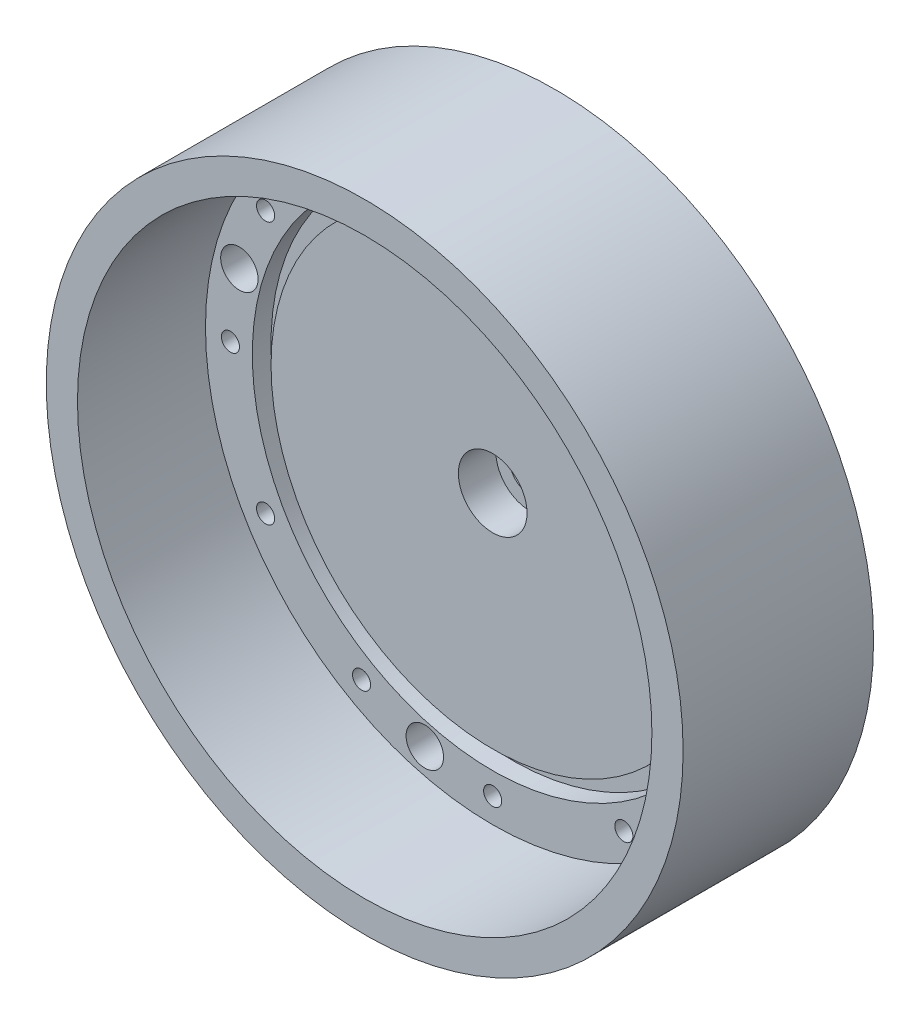
ISO-10303-21;
HEADER;
FILE_DESCRIPTION(('STEP AP214'),'2;1');
FILE_NAME('part.step','',(''),(''),'','','');
FILE_SCHEMA(('AUTOMOTIVE_DESIGN { 1 0 10303 214 1 1 1 1 }'));
ENDSEC;
DATA;
#1=APPLICATION_CONTEXT('core data for automotive mechanical design processes');
#2=APPLICATION_PROTOCOL_DEFINITION('international standard','automotive_design',2000,#1);
#3=PRODUCT_CONTEXT('',#1,'mechanical');
#4=PRODUCT('Part','Part','',(#3));
#5=PRODUCT_RELATED_PRODUCT_CATEGORY('part','',(#4));
#6=PRODUCT_DEFINITION_FORMATION('','',#4);
#7=PRODUCT_DEFINITION_CONTEXT('part definition',#1,'design');
#8=PRODUCT_DEFINITION('design','',#6,#7);
#9=PRODUCT_DEFINITION_SHAPE('','',#8);
#10=(LENGTH_UNIT() NAMED_UNIT(*) SI_UNIT(.MILLI.,.METRE.));
#11=(NAMED_UNIT(*) PLANE_ANGLE_UNIT() SI_UNIT($,.RADIAN.));
#12=(NAMED_UNIT(*) SI_UNIT($,.STERADIAN.) SOLID_ANGLE_UNIT());
#13=UNCERTAINTY_MEASURE_WITH_UNIT(LENGTH_MEASURE(1.E-05),#10,'distance_accuracy_value','');
#14=(GEOMETRIC_REPRESENTATION_CONTEXT(3) GLOBAL_UNCERTAINTY_ASSIGNED_CONTEXT((#13)) GLOBAL_UNIT_ASSIGNED_CONTEXT((#10,
#11,#12)) REPRESENTATION_CONTEXT('',''));
#15=CARTESIAN_POINT('',(0.,0.,0.));
#16=DIRECTION('',(0.,0.,1.));
#17=DIRECTION('',(1.,0.,0.));
#18=AXIS2_PLACEMENT_3D('',#15,#16,#17);
#19=CARTESIAN_POINT('',(0.,-5.05767303038418E-11,0.));
#20=DIRECTION('',(0.,0.,1.));
#21=DIRECTION('',(1.,0.,0.));
#22=AXIS2_PLACEMENT_3D('',#19,#20,#21);
#23=PLANE('',#22);
#24=CARTESIAN_POINT('',(0.,0.,0.));
#25=DIRECTION('',(0.,0.,1.));
#26=DIRECTION('',(1.,0.,0.));
#27=AXIS2_PLACEMENT_3D('',#24,#25,#26);
#28=CIRCLE('',#27,3.3);
#29=CARTESIAN_POINT('',(3.3,0.,0.));
#30=VERTEX_POINT('',#29);
#31=EDGE_CURVE('E464',#30,#30,#28,.T.);
#32=ORIENTED_EDGE('',*,*,#31,.T.);
#33=EDGE_LOOP('',(#32));
#34=FACE_BOUND('',#33,.T.);
#35=CARTESIAN_POINT('',(10.8703998943058,40.5688847041003,0.));
#36=DIRECTION('',(0.,0.,-1.));
#37=DIRECTION('',(-1.,0.,0.));
#38=AXIS2_PLACEMENT_3D('',#35,#36,#37);
#39=CIRCLE('',#38,3.);
#40=CARTESIAN_POINT('',(7.87039989430581,40.5688847041003,0.));
#41=VERTEX_POINT('',#40);
#42=EDGE_CURVE('E476',#41,#41,#39,.T.);
#43=ORIENTED_EDGE('',*,*,#42,.F.);
#44=EDGE_LOOP('',(#43));
#45=FACE_BOUND('',#44,.T.);
#46=CARTESIAN_POINT('',(-40.568884704141,10.8703998942653,0.));
#47=DIRECTION('',(0.,0.,-1.));
#48=DIRECTION('',(-1.,0.,0.));
#49=AXIS2_PLACEMENT_3D('',#46,#47,#48);
#50=CIRCLE('',#49,3.);
#51=CARTESIAN_POINT('',(-43.568884704141,10.8703998942653,0.));
#52=VERTEX_POINT('',#51);
#53=EDGE_CURVE('E89',#52,#52,#50,.T.);
#54=ORIENTED_EDGE('',*,*,#53,.F.);
#55=EDGE_LOOP('',(#54));
#56=FACE_BOUND('',#55,.T.);
#57=CARTESIAN_POINT('',(-10.870399894306,-40.5688847041815,0.));
#58=DIRECTION('',(0.,0.,-1.));
#59=DIRECTION('',(-1.,0.,0.));
#60=AXIS2_PLACEMENT_3D('',#57,#58,#59);
#61=CIRCLE('',#60,3.);
#62=CARTESIAN_POINT('',(-13.870399894306,-40.5688847041815,0.));
#63=VERTEX_POINT('',#62);
#64=EDGE_CURVE('E77',#63,#63,#61,.T.);
#65=ORIENTED_EDGE('',*,*,#64,.F.);
#66=EDGE_LOOP('',(#65));
#67=FACE_BOUND('',#66,.T.);
#68=CARTESIAN_POINT('',(40.5688847041408,-10.8703998943465,0.));
#69=DIRECTION('',(0.,0.,-1.));
#70=DIRECTION('',(-1.,0.,0.));
#71=AXIS2_PLACEMENT_3D('',#68,#69,#70);
#72=CIRCLE('',#71,3.);
#73=CARTESIAN_POINT('',(37.5688847041408,-10.8703998943465,0.));
#74=VERTEX_POINT('',#73);
#75=EDGE_CURVE('E76',#74,#74,#72,.T.);
#76=ORIENTED_EDGE('',*,*,#75,.F.);
#77=EDGE_LOOP('',(#76));
#78=FACE_BOUND('',#77,.T.);
#79=CARTESIAN_POINT('',(-21.0000000000001,36.3730669589058,0.));
#80=DIRECTION('',(0.,0.,-1.));
#81=DIRECTION('',(-1.,0.,0.));
#82=AXIS2_PLACEMENT_3D('',#79,#80,#81);
#83=CIRCLE('',#82,1.45);
#84=CARTESIAN_POINT('',(-22.4500000000001,36.3730669589058,0.));
#85=VERTEX_POINT('',#84);
#86=EDGE_CURVE('E73',#85,#85,#83,.T.);
#87=ORIENTED_EDGE('',*,*,#86,.F.);
#88=EDGE_LOOP('',(#87));
#89=FACE_BOUND('',#88,.T.);
#90=CARTESIAN_POINT('',(-36.3730669589465,20.9999999999594,0.));
#91=DIRECTION('',(0.,0.,-1.));
#92=DIRECTION('',(-1.,0.,0.));
#93=AXIS2_PLACEMENT_3D('',#90,#91,#92);
#94=CIRCLE('',#93,1.45);
#95=CARTESIAN_POINT('',(-37.8230669589465,20.9999999999594,0.));
#96=VERTEX_POINT('',#95);
#97=EDGE_CURVE('E72',#96,#96,#94,.T.);
#98=ORIENTED_EDGE('',*,*,#97,.F.);
#99=EDGE_LOOP('',(#98));
#100=FACE_BOUND('',#99,.T.);
#101=CARTESIAN_POINT('',(-36.3730669589465,-21.0000000000406,0.));
#102=DIRECTION('',(0.,0.,-1.));
#103=DIRECTION('',(-1.,0.,0.));
#104=AXIS2_PLACEMENT_3D('',#101,#102,#103);
#105=CIRCLE('',#104,1.45);
#106=CARTESIAN_POINT('',(-37.8230669589465,-21.0000000000406,0.));
#107=VERTEX_POINT('',#106);
#108=EDGE_CURVE('E68',#107,#107,#105,.T.);
#109=ORIENTED_EDGE('',*,*,#108,.F.);
#110=EDGE_LOOP('',(#109));
#111=FACE_BOUND('',#110,.T.);
#112=CARTESIAN_POINT('',(-21.0000000000001,-36.373066958987,0.));
#113=DIRECTION('',(0.,0.,-1.));
#114=DIRECTION('',(-1.,0.,0.));
#115=AXIS2_PLACEMENT_3D('',#112,#113,#114);
#116=CIRCLE('',#115,1.45);
#117=CARTESIAN_POINT('',(-22.4500000000001,-36.373066958987,0.));
#118=VERTEX_POINT('',#117);
#119=EDGE_CURVE('E64',#118,#118,#116,.T.);
#120=ORIENTED_EDGE('',*,*,#119,.F.);
#121=EDGE_LOOP('',(#120));
#122=FACE_BOUND('',#121,.T.);
#123=CARTESIAN_POINT('',(0.,-42.0000000000406,0.));
#124=DIRECTION('',(0.,0.,-1.));
#125=DIRECTION('',(-1.,0.,0.));
#126=AXIS2_PLACEMENT_3D('',#123,#124,#125);
#127=CIRCLE('',#126,1.45);
#128=CARTESIAN_POINT('',(-1.45000000000008,-42.0000000000406,0.));
#129=VERTEX_POINT('',#128);
#130=EDGE_CURVE('E63',#129,#129,#127,.T.);
#131=ORIENTED_EDGE('',*,*,#130,.F.);
#132=EDGE_LOOP('',(#131));
#133=FACE_BOUND('',#132,.T.);
#134=CARTESIAN_POINT('',(20.9999999999999,-36.373066958987,0.));
#135=DIRECTION('',(0.,0.,-1.));
#136=DIRECTION('',(-1.,0.,0.));
#137=AXIS2_PLACEMENT_3D('',#134,#135,#136);
#138=CIRCLE('',#137,1.45);
#139=CARTESIAN_POINT('',(19.5499999999999,-36.373066958987,0.));
#140=VERTEX_POINT('',#139);
#141=EDGE_CURVE('E116',#140,#140,#138,.T.);
#142=ORIENTED_EDGE('',*,*,#141,.F.);
#143=EDGE_LOOP('',(#142));
#144=FACE_BOUND('',#143,.T.);
#145=CARTESIAN_POINT('',(36.3730669589463,-21.0000000000406,0.));
#146=DIRECTION('',(0.,0.,-1.));
#147=DIRECTION('',(-1.,0.,0.));
#148=AXIS2_PLACEMENT_3D('',#145,#146,#147);
#149=CIRCLE('',#148,1.45);
#150=CARTESIAN_POINT('',(34.9230669589463,-21.0000000000406,0.));
#151=VERTEX_POINT('',#150);
#152=EDGE_CURVE('E122',#151,#151,#149,.T.);
#153=ORIENTED_EDGE('',*,*,#152,.F.);
#154=EDGE_LOOP('',(#153));
#155=FACE_BOUND('',#154,.T.);
#156=CARTESIAN_POINT('',(41.9999999999999,-4.05743147413595E-11,0.));
#157=DIRECTION('',(0.,0.,-1.));
#158=DIRECTION('',(-1.,0.,0.));
#159=AXIS2_PLACEMENT_3D('',#156,#157,#158);
#160=CIRCLE('',#159,1.45);
#161=CARTESIAN_POINT('',(40.5499999999999,-4.05743147413595E-11,0.));
#162=VERTEX_POINT('',#161);
#163=EDGE_CURVE('E128',#162,#162,#160,.T.);
#164=ORIENTED_EDGE('',*,*,#163,.F.);
#165=EDGE_LOOP('',(#164));
#166=FACE_BOUND('',#165,.T.);
#167=CARTESIAN_POINT('',(36.3730669589463,20.9999999999594,0.));
#168=DIRECTION('',(0.,0.,-1.));
#169=DIRECTION('',(-1.,0.,0.));
#170=AXIS2_PLACEMENT_3D('',#167,#168,#169);
#171=CIRCLE('',#170,1.45);
#172=CARTESIAN_POINT('',(34.9230669589463,20.9999999999594,0.));
#173=VERTEX_POINT('',#172);
#174=EDGE_CURVE('E134',#173,#173,#171,.T.);
#175=ORIENTED_EDGE('',*,*,#174,.F.);
#176=EDGE_LOOP('',(#175));
#177=FACE_BOUND('',#176,.T.);
#178=CARTESIAN_POINT('',(20.9999999999999,36.3730669589058,0.));
#179=DIRECTION('',(0.,0.,-1.));
#180=DIRECTION('',(-1.,0.,0.));
#181=AXIS2_PLACEMENT_3D('',#178,#179,#180);
#182=CIRCLE('',#181,1.45);
#183=CARTESIAN_POINT('',(19.5499999999999,36.3730669589058,0.));
#184=VERTEX_POINT('',#183);
#185=EDGE_CURVE('E140',#184,#184,#182,.T.);
#186=ORIENTED_EDGE('',*,*,#185,.F.);
#187=EDGE_LOOP('',(#186));
#188=FACE_BOUND('',#187,.T.);
#189=CARTESIAN_POINT('',(0.,41.9999999999594,0.));
#190=DIRECTION('',(0.,0.,-1.));
#191=DIRECTION('',(-1.,0.,0.));
#192=AXIS2_PLACEMENT_3D('',#189,#190,#191);
#193=CIRCLE('',#192,1.45);
#194=CARTESIAN_POINT('',(-1.45000000000009,41.9999999999594,0.));
#195=VERTEX_POINT('',#194);
#196=EDGE_CURVE('E59',#195,#195,#193,.T.);
#197=ORIENTED_EDGE('',*,*,#196,.F.);
#198=EDGE_LOOP('',(#197));
#199=FACE_BOUND('',#198,.T.);
#200=CARTESIAN_POINT('',(0.,-5.05767303038418E-11,0.));
#201=DIRECTION('',(0.,0.,1.));
#202=DIRECTION('',(1.,0.,0.));
#203=AXIS2_PLACEMENT_3D('',#200,#201,#202);
#204=CIRCLE('',#203,51.0000000000607);
#205=CARTESIAN_POINT('',(51.0000000000606,-5.05767303038418E-11,0.));
#206=VERTEX_POINT('',#205);
#207=EDGE_CURVE('E45',#206,#206,#204,.T.);
#208=ORIENTED_EDGE('',*,*,#207,.F.);
#209=EDGE_LOOP('',(#208));
#210=FACE_BOUND('',#209,.T.);
#211=CARTESIAN_POINT('',(-42.0000000000001,-4.05786515500495E-11,0.));
#212=DIRECTION('',(0.,0.,-1.));
#213=DIRECTION('',(-1.,0.,0.));
#214=AXIS2_PLACEMENT_3D('',#211,#212,#213);
#215=CIRCLE('',#214,1.45);
#216=CARTESIAN_POINT('',(-43.4500000000001,-4.05786515500495E-11,0.));
#217=VERTEX_POINT('',#216);
#218=EDGE_CURVE('E69',#217,#217,#215,.T.);
#219=ORIENTED_EDGE('',*,*,#218,.F.);
#220=EDGE_LOOP('',(#219));
#221=FACE_BOUND('',#220,.T.);
#222=ADVANCED_FACE('F37',(#34,#45,#56,#67,#78,#89,#100,#111,#122,#133,#144,#155,#166,#177,#188,
#199,#210,#221),#23,.F.);
#223=CARTESIAN_POINT('',(0.,-5.05767303038418E-11,30.5));
#224=DIRECTION('',(0.,0.,-1.));
#225=DIRECTION('',(-1.,0.,0.));
#226=AXIS2_PLACEMENT_3D('',#223,#224,#225);
#227=CYLINDRICAL_SURFACE('',#226,51.0000000000607);
#228=CARTESIAN_POINT('',(0.,-5.05767303038418E-11,30.5));
#229=DIRECTION('',(0.,0.,1.));
#230=DIRECTION('',(1.,0.,0.));
#231=AXIS2_PLACEMENT_3D('',#228,#229,#230);
#232=CIRCLE('',#231,51.0000000000607);
#233=CARTESIAN_POINT('',(51.0000000000606,-5.05767303038418E-11,30.5));
#234=VERTEX_POINT('',#233);
#235=EDGE_CURVE('E11',#234,#234,#232,.T.);
#236=ORIENTED_EDGE('',*,*,#235,.F.);
#237=EDGE_LOOP('',(#236));
#238=FACE_BOUND('',#237,.T.);
#239=ORIENTED_EDGE('',*,*,#207,.T.);
#240=EDGE_LOOP('',(#239));
#241=FACE_BOUND('',#240,.T.);
#242=ADVANCED_FACE('F39',(#238,#241),#227,.T.);
#243=CARTESIAN_POINT('',(0.,-5.05767303038418E-11,30.5));
#244=DIRECTION('',(0.,0.,1.));
#245=DIRECTION('',(1.,0.,0.));
#246=AXIS2_PLACEMENT_3D('',#243,#244,#245);
#247=PLANE('',#246);
#248=CARTESIAN_POINT('',(0.,-5.05767303038418E-11,30.5));
#249=DIRECTION('',(0.,0.,1.));
#250=DIRECTION('',(1.,0.,0.));
#251=AXIS2_PLACEMENT_3D('',#248,#249,#250);
#252=CIRCLE('',#251,46.00000000001);
#253=CARTESIAN_POINT('',(46.0000000000099,-5.05767303038418E-11,30.5));
#254=VERTEX_POINT('',#253);
#255=EDGE_CURVE('E58',#254,#254,#252,.T.);
#256=ORIENTED_EDGE('',*,*,#255,.F.);
#257=EDGE_LOOP('',(#256));
#258=FACE_BOUND('',#257,.T.);
#259=ORIENTED_EDGE('',*,*,#235,.T.);
#260=EDGE_LOOP('',(#259));
#261=FACE_BOUND('',#260,.T.);
#262=ADVANCED_FACE('F168',(#258,#261),#247,.T.);
#263=CARTESIAN_POINT('',(0.,-5.05767303038418E-11,-130.107647738353));
#264=DIRECTION('',(0.,0.,1.));
#265=DIRECTION('',(1.,0.,0.));
#266=AXIS2_PLACEMENT_3D('',#263,#264,#265);
#267=CYLINDRICAL_SURFACE('',#266,46.00000000001);
#268=CARTESIAN_POINT('',(0.,-5.05767303038418E-11,10.));
#269=DIRECTION('',(0.,0.,1.));
#270=DIRECTION('',(1.,0.,0.));
#271=AXIS2_PLACEMENT_3D('',#268,#269,#270);
#272=CIRCLE('',#271,46.00000000001);
#273=CARTESIAN_POINT('',(46.0000000000099,-5.05767303038418E-11,10.));
#274=VERTEX_POINT('',#273);
#275=EDGE_CURVE('E50',#274,#274,#272,.F.);
#276=ORIENTED_EDGE('',*,*,#275,.T.);
#277=EDGE_LOOP('',(#276));
#278=FACE_BOUND('',#277,.T.);
#279=ORIENTED_EDGE('',*,*,#255,.T.);
#280=EDGE_LOOP('',(#279));
#281=FACE_BOUND('',#280,.T.);
#282=ADVANCED_FACE('F153',(#278,#281),#267,.F.);
#283=CARTESIAN_POINT('',(0.,-5.05767303038418E-11,10.));
#284=DIRECTION('',(0.,0.,1.));
#285=DIRECTION('',(1.,0.,0.));
#286=AXIS2_PLACEMENT_3D('',#283,#284,#285);
#287=PLANE('',#286);
#288=CARTESIAN_POINT('',(0.,-5.05767303038418E-11,10.));
#289=DIRECTION('',(0.,0.,1.));
#290=DIRECTION('',(1.,0.,0.));
#291=AXIS2_PLACEMENT_3D('',#288,#289,#290);
#292=CIRCLE('',#291,38.5);
#293=CARTESIAN_POINT('',(38.4999999999999,-5.05767303038418E-11,10.));
#294=VERTEX_POINT('',#293);
#295=EDGE_CURVE('E470',#294,#294,#292,.T.);
#296=ORIENTED_EDGE('',*,*,#295,.F.);
#297=EDGE_LOOP('',(#296));
#298=FACE_BOUND('',#297,.T.);
#299=CARTESIAN_POINT('',(10.8703998943058,40.5688847041003,10.));
#300=DIRECTION('',(0.,0.,1.));
#301=DIRECTION('',(1.,0.,0.));
#302=AXIS2_PLACEMENT_3D('',#299,#300,#301);
#303=CIRCLE('',#302,2.99999999999999);
#304=CARTESIAN_POINT('',(13.8703998943058,40.5688847041003,10.));
#305=VERTEX_POINT('',#304);
#306=EDGE_CURVE('E41',#305,#305,#303,.T.);
#307=ORIENTED_EDGE('',*,*,#306,.F.);
#308=EDGE_LOOP('',(#307));
#309=FACE_BOUND('',#308,.T.);
#310=CARTESIAN_POINT('',(-40.568884704141,10.8703998942653,10.));
#311=DIRECTION('',(0.,0.,1.));
#312=DIRECTION('',(1.,0.,0.));
#313=AXIS2_PLACEMENT_3D('',#310,#311,#312);
#314=CIRCLE('',#313,3.);
#315=CARTESIAN_POINT('',(-37.568884704141,10.8703998942653,10.));
#316=VERTEX_POINT('',#315);
#317=EDGE_CURVE('E84',#316,#316,#314,.T.);
#318=ORIENTED_EDGE('',*,*,#317,.F.);
#319=EDGE_LOOP('',(#318));
#320=FACE_BOUND('',#319,.T.);
#321=CARTESIAN_POINT('',(-10.870399894306,-40.5688847041815,10.));
#322=DIRECTION('',(0.,0.,1.));
#323=DIRECTION('',(1.,0.,0.));
#324=AXIS2_PLACEMENT_3D('',#321,#322,#323);
#325=CIRCLE('',#324,2.99999999999999);
#326=CARTESIAN_POINT('',(-7.870399894306,-40.5688847041815,10.));
#327=VERTEX_POINT('',#326);
#328=EDGE_CURVE('E74',#327,#327,#325,.T.);
#329=ORIENTED_EDGE('',*,*,#328,.F.);
#330=EDGE_LOOP('',(#329));
#331=FACE_BOUND('',#330,.T.);
#332=CARTESIAN_POINT('',(40.5688847041408,-10.8703998943465,10.));
#333=DIRECTION('',(0.,0.,1.));
#334=DIRECTION('',(1.,0.,0.));
#335=AXIS2_PLACEMENT_3D('',#332,#333,#334);
#336=CIRCLE('',#335,3.);
#337=CARTESIAN_POINT('',(43.5688847041408,-10.8703998943465,10.));
#338=VERTEX_POINT('',#337);
#339=EDGE_CURVE('E81',#338,#338,#336,.T.);
#340=ORIENTED_EDGE('',*,*,#339,.F.);
#341=EDGE_LOOP('',(#340));
#342=FACE_BOUND('',#341,.T.);
#343=CARTESIAN_POINT('',(-21.0000000000001,36.3730669589058,10.));
#344=DIRECTION('',(0.,0.,1.));
#345=DIRECTION('',(1.,0.,0.));
#346=AXIS2_PLACEMENT_3D('',#343,#344,#345);
#347=CIRCLE('',#346,1.44999999999999);
#348=CARTESIAN_POINT('',(-19.5500000000001,36.3730669589058,10.));
#349=VERTEX_POINT('',#348);
#350=EDGE_CURVE('E70',#349,#349,#347,.T.);
#351=ORIENTED_EDGE('',*,*,#350,.F.);
#352=EDGE_LOOP('',(#351));
#353=FACE_BOUND('',#352,.T.);
#354=CARTESIAN_POINT('',(-36.3730669589465,20.9999999999594,10.));
#355=DIRECTION('',(0.,0.,1.));
#356=DIRECTION('',(1.,0.,0.));
#357=AXIS2_PLACEMENT_3D('',#354,#355,#356);
#358=CIRCLE('',#357,1.45);
#359=CARTESIAN_POINT('',(-34.9230669589465,20.9999999999594,10.));
#360=VERTEX_POINT('',#359);
#361=EDGE_CURVE('E99',#360,#360,#358,.T.);
#362=ORIENTED_EDGE('',*,*,#361,.F.);
#363=EDGE_LOOP('',(#362));
#364=FACE_BOUND('',#363,.T.);
#365=CARTESIAN_POINT('',(-42.0000000000001,-4.05786515500495E-11,10.));
#366=DIRECTION('',(0.,0.,1.));
#367=DIRECTION('',(1.,0.,0.));
#368=AXIS2_PLACEMENT_3D('',#365,#366,#367);
#369=CIRCLE('',#368,1.45);
#370=CARTESIAN_POINT('',(-40.5500000000001,-4.05786515500495E-11,10.));
#371=VERTEX_POINT('',#370);
#372=EDGE_CURVE('E65',#371,#371,#369,.T.);
#373=ORIENTED_EDGE('',*,*,#372,.F.);
#374=EDGE_LOOP('',(#373));
#375=FACE_BOUND('',#374,.T.);
#376=CARTESIAN_POINT('',(-36.3730669589465,-21.0000000000406,10.));
#377=DIRECTION('',(0.,0.,1.));
#378=DIRECTION('',(1.,0.,0.));
#379=AXIS2_PLACEMENT_3D('',#376,#377,#378);
#380=CIRCLE('',#379,1.45);
#381=CARTESIAN_POINT('',(-34.9230669589465,-21.0000000000406,10.));
#382=VERTEX_POINT('',#381);
#383=EDGE_CURVE('E106',#382,#382,#380,.T.);
#384=ORIENTED_EDGE('',*,*,#383,.F.);
#385=EDGE_LOOP('',(#384));
#386=FACE_BOUND('',#385,.T.);
#387=CARTESIAN_POINT('',(-21.0000000000001,-36.373066958987,10.));
#388=DIRECTION('',(0.,0.,1.));
#389=DIRECTION('',(1.,0.,0.));
#390=AXIS2_PLACEMENT_3D('',#387,#388,#389);
#391=CIRCLE('',#390,1.44999999999999);
#392=CARTESIAN_POINT('',(-19.5500000000001,-36.373066958987,10.));
#393=VERTEX_POINT('',#392);
#394=EDGE_CURVE('E60',#393,#393,#391,.T.);
#395=ORIENTED_EDGE('',*,*,#394,.F.);
#396=EDGE_LOOP('',(#395));
#397=FACE_BOUND('',#396,.T.);
#398=CARTESIAN_POINT('',(0.,-42.0000000000406,10.));
#399=DIRECTION('',(0.,0.,1.));
#400=DIRECTION('',(1.,0.,0.));
#401=AXIS2_PLACEMENT_3D('',#398,#399,#400);
#402=CIRCLE('',#401,1.44999999999999);
#403=CARTESIAN_POINT('',(1.44999999999991,-42.0000000000406,10.));
#404=VERTEX_POINT('',#403);
#405=EDGE_CURVE('E113',#404,#404,#402,.T.);
#406=ORIENTED_EDGE('',*,*,#405,.F.);
#407=EDGE_LOOP('',(#406));
#408=FACE_BOUND('',#407,.T.);
#409=CARTESIAN_POINT('',(20.9999999999999,-36.373066958987,10.));
#410=DIRECTION('',(0.,0.,1.));
#411=DIRECTION('',(1.,0.,0.));
#412=AXIS2_PLACEMENT_3D('',#409,#410,#411);
#413=CIRCLE('',#412,1.44999999999999);
#414=CARTESIAN_POINT('',(22.4499999999999,-36.373066958987,10.));
#415=VERTEX_POINT('',#414);
#416=EDGE_CURVE('E119',#415,#415,#413,.T.);
#417=ORIENTED_EDGE('',*,*,#416,.F.);
#418=EDGE_LOOP('',(#417));
#419=FACE_BOUND('',#418,.T.);
#420=CARTESIAN_POINT('',(36.3730669589463,-21.0000000000406,10.));
#421=DIRECTION('',(0.,0.,1.));
#422=DIRECTION('',(1.,0.,0.));
#423=AXIS2_PLACEMENT_3D('',#420,#421,#422);
#424=CIRCLE('',#423,1.45);
#425=CARTESIAN_POINT('',(37.8230669589463,-21.0000000000406,10.));
#426=VERTEX_POINT('',#425);
#427=EDGE_CURVE('E125',#426,#426,#424,.T.);
#428=ORIENTED_EDGE('',*,*,#427,.F.);
#429=EDGE_LOOP('',(#428));
#430=FACE_BOUND('',#429,.T.);
#431=CARTESIAN_POINT('',(41.9999999999999,-4.05743147413595E-11,10.));
#432=DIRECTION('',(0.,0.,1.));
#433=DIRECTION('',(1.,0.,0.));
#434=AXIS2_PLACEMENT_3D('',#431,#432,#433);
#435=CIRCLE('',#434,1.45);
#436=CARTESIAN_POINT('',(43.4499999999999,-4.05743147413595E-11,10.));
#437=VERTEX_POINT('',#436);
#438=EDGE_CURVE('E131',#437,#437,#435,.T.);
#439=ORIENTED_EDGE('',*,*,#438,.F.);
#440=EDGE_LOOP('',(#439));
#441=FACE_BOUND('',#440,.T.);
#442=CARTESIAN_POINT('',(36.3730669589463,20.9999999999594,10.));
#443=DIRECTION('',(0.,0.,1.));
#444=DIRECTION('',(1.,0.,0.));
#445=AXIS2_PLACEMENT_3D('',#442,#443,#444);
#446=CIRCLE('',#445,1.45);
#447=CARTESIAN_POINT('',(37.8230669589463,20.9999999999594,10.));
#448=VERTEX_POINT('',#447);
#449=EDGE_CURVE('E137',#448,#448,#446,.T.);
#450=ORIENTED_EDGE('',*,*,#449,.F.);
#451=EDGE_LOOP('',(#450));
#452=FACE_BOUND('',#451,.T.);
#453=CARTESIAN_POINT('',(20.9999999999999,36.3730669589058,10.));
#454=DIRECTION('',(0.,0.,1.));
#455=DIRECTION('',(1.,0.,0.));
#456=AXIS2_PLACEMENT_3D('',#453,#454,#455);
#457=CIRCLE('',#456,1.44999999999999);
#458=CARTESIAN_POINT('',(22.4499999999999,36.3730669589058,10.));
#459=VERTEX_POINT('',#458);
#460=EDGE_CURVE('E143',#459,#459,#457,.T.);
#461=ORIENTED_EDGE('',*,*,#460,.F.);
#462=EDGE_LOOP('',(#461));
#463=FACE_BOUND('',#462,.T.);
#464=CARTESIAN_POINT('',(0.,41.9999999999594,10.));
#465=DIRECTION('',(0.,0.,1.));
#466=DIRECTION('',(1.,0.,0.));
#467=AXIS2_PLACEMENT_3D('',#464,#465,#466);
#468=CIRCLE('',#467,1.44999999999999);
#469=CARTESIAN_POINT('',(1.4499999999999,41.9999999999594,10.));
#470=VERTEX_POINT('',#469);
#471=EDGE_CURVE('E55',#470,#470,#468,.T.);
#472=ORIENTED_EDGE('',*,*,#471,.F.);
#473=EDGE_LOOP('',(#472));
#474=FACE_BOUND('',#473,.T.);
#475=ORIENTED_EDGE('',*,*,#275,.F.);
#476=EDGE_LOOP('',(#475));
#477=FACE_BOUND('',#476,.T.);
#478=ADVANCED_FACE('F155',(#298,#309,#320,#331,#342,#353,#364,#375,#386,#397,#408,#419,#430,
#441,#452,#463,#474,#477),#287,.T.);
#479=CARTESIAN_POINT('',(0.,41.9999999999594,0.));
#480=DIRECTION('',(0.,0.,-1.));
#481=DIRECTION('',(-1.,0.,0.));
#482=AXIS2_PLACEMENT_3D('',#479,#480,#481);
#483=CYLINDRICAL_SURFACE('',#482,1.44999999999999);
#484=ORIENTED_EDGE('',*,*,#471,.T.);
#485=EDGE_LOOP('',(#484));
#486=FACE_BOUND('',#485,.T.);
#487=ORIENTED_EDGE('',*,*,#196,.T.);
#488=EDGE_LOOP('',(#487));
#489=FACE_BOUND('',#488,.T.);
#490=ADVANCED_FACE('F157',(#486,#489),#483,.F.);
#491=CARTESIAN_POINT('',(20.9999999999999,36.3730669589058,0.));
#492=DIRECTION('',(0.,0.,-1.));
#493=DIRECTION('',(-1.,0.,0.));
#494=AXIS2_PLACEMENT_3D('',#491,#492,#493);
#495=CYLINDRICAL_SURFACE('',#494,1.44999999999999);
#496=ORIENTED_EDGE('',*,*,#460,.T.);
#497=EDGE_LOOP('',(#496));
#498=FACE_BOUND('',#497,.T.);
#499=ORIENTED_EDGE('',*,*,#185,.T.);
#500=EDGE_LOOP('',(#499));
#501=FACE_BOUND('',#500,.T.);
#502=ADVANCED_FACE('F165',(#498,#501),#495,.F.);
#503=CARTESIAN_POINT('',(36.3730669589463,20.9999999999594,0.));
#504=DIRECTION('',(0.,0.,-1.));
#505=DIRECTION('',(-1.,0.,0.));
#506=AXIS2_PLACEMENT_3D('',#503,#504,#505);
#507=CYLINDRICAL_SURFACE('',#506,1.45);
#508=ORIENTED_EDGE('',*,*,#449,.T.);
#509=EDGE_LOOP('',(#508));
#510=FACE_BOUND('',#509,.T.);
#511=ORIENTED_EDGE('',*,*,#174,.T.);
#512=EDGE_LOOP('',(#511));
#513=FACE_BOUND('',#512,.T.);
#514=ADVANCED_FACE('F215',(#510,#513),#507,.F.);
#515=CARTESIAN_POINT('',(41.9999999999999,-4.05743147413595E-11,0.));
#516=DIRECTION('',(0.,0.,-1.));
#517=DIRECTION('',(-1.,0.,0.));
#518=AXIS2_PLACEMENT_3D('',#515,#516,#517);
#519=CYLINDRICAL_SURFACE('',#518,1.45);
#520=ORIENTED_EDGE('',*,*,#438,.T.);
#521=EDGE_LOOP('',(#520));
#522=FACE_BOUND('',#521,.T.);
#523=ORIENTED_EDGE('',*,*,#163,.T.);
#524=EDGE_LOOP('',(#523));
#525=FACE_BOUND('',#524,.T.);
#526=ADVANCED_FACE('F227',(#522,#525),#519,.F.);
#527=CARTESIAN_POINT('',(36.3730669589463,-21.0000000000406,0.));
#528=DIRECTION('',(0.,0.,-1.));
#529=DIRECTION('',(-1.,0.,0.));
#530=AXIS2_PLACEMENT_3D('',#527,#528,#529);
#531=CYLINDRICAL_SURFACE('',#530,1.45);
#532=ORIENTED_EDGE('',*,*,#427,.T.);
#533=EDGE_LOOP('',(#532));
#534=FACE_BOUND('',#533,.T.);
#535=ORIENTED_EDGE('',*,*,#152,.T.);
#536=EDGE_LOOP('',(#535));
#537=FACE_BOUND('',#536,.T.);
#538=ADVANCED_FACE('F239',(#534,#537),#531,.F.);
#539=CARTESIAN_POINT('',(20.9999999999999,-36.373066958987,0.));
#540=DIRECTION('',(0.,0.,-1.));
#541=DIRECTION('',(-1.,0.,0.));
#542=AXIS2_PLACEMENT_3D('',#539,#540,#541);
#543=CYLINDRICAL_SURFACE('',#542,1.44999999999999);
#544=ORIENTED_EDGE('',*,*,#416,.T.);
#545=EDGE_LOOP('',(#544));
#546=FACE_BOUND('',#545,.T.);
#547=ORIENTED_EDGE('',*,*,#141,.T.);
#548=EDGE_LOOP('',(#547));
#549=FACE_BOUND('',#548,.T.);
#550=ADVANCED_FACE('F251',(#546,#549),#543,.F.);
#551=CARTESIAN_POINT('',(0.,-42.0000000000406,0.));
#552=DIRECTION('',(0.,0.,-1.));
#553=DIRECTION('',(-1.,0.,0.));
#554=AXIS2_PLACEMENT_3D('',#551,#552,#553);
#555=CYLINDRICAL_SURFACE('',#554,1.44999999999999);
#556=ORIENTED_EDGE('',*,*,#405,.T.);
#557=EDGE_LOOP('',(#556));
#558=FACE_BOUND('',#557,.T.);
#559=ORIENTED_EDGE('',*,*,#130,.T.);
#560=EDGE_LOOP('',(#559));
#561=FACE_BOUND('',#560,.T.);
#562=ADVANCED_FACE('F263',(#558,#561),#555,.F.);
#563=CARTESIAN_POINT('',(-21.0000000000001,-36.373066958987,0.));
#564=DIRECTION('',(0.,0.,-1.));
#565=DIRECTION('',(-1.,0.,0.));
#566=AXIS2_PLACEMENT_3D('',#563,#564,#565);
#567=CYLINDRICAL_SURFACE('',#566,1.44999999999999);
#568=ORIENTED_EDGE('',*,*,#394,.T.);
#569=EDGE_LOOP('',(#568));
#570=FACE_BOUND('',#569,.T.);
#571=ORIENTED_EDGE('',*,*,#119,.T.);
#572=EDGE_LOOP('',(#571));
#573=FACE_BOUND('',#572,.T.);
#574=ADVANCED_FACE('F275',(#570,#573),#567,.F.);
#575=CARTESIAN_POINT('',(-36.3730669589465,-21.0000000000406,0.));
#576=DIRECTION('',(0.,0.,-1.));
#577=DIRECTION('',(-1.,0.,0.));
#578=AXIS2_PLACEMENT_3D('',#575,#576,#577);
#579=CYLINDRICAL_SURFACE('',#578,1.45);
#580=ORIENTED_EDGE('',*,*,#383,.T.);
#581=EDGE_LOOP('',(#580));
#582=FACE_BOUND('',#581,.T.);
#583=ORIENTED_EDGE('',*,*,#108,.T.);
#584=EDGE_LOOP('',(#583));
#585=FACE_BOUND('',#584,.T.);
#586=ADVANCED_FACE('F287',(#582,#585),#579,.F.);
#587=CARTESIAN_POINT('',(-42.0000000000001,-4.05786515500495E-11,0.));
#588=DIRECTION('',(0.,0.,-1.));
#589=DIRECTION('',(-1.,0.,0.));
#590=AXIS2_PLACEMENT_3D('',#587,#588,#589);
#591=CYLINDRICAL_SURFACE('',#590,1.45);
#592=ORIENTED_EDGE('',*,*,#372,.T.);
#593=EDGE_LOOP('',(#592));
#594=FACE_BOUND('',#593,.T.);
#595=ORIENTED_EDGE('',*,*,#218,.T.);
#596=EDGE_LOOP('',(#595));
#597=FACE_BOUND('',#596,.T.);
#598=ADVANCED_FACE('F299',(#594,#597),#591,.F.);
#599=CARTESIAN_POINT('',(-36.3730669589465,20.9999999999594,0.));
#600=DIRECTION('',(0.,0.,-1.));
#601=DIRECTION('',(-1.,0.,0.));
#602=AXIS2_PLACEMENT_3D('',#599,#600,#601);
#603=CYLINDRICAL_SURFACE('',#602,1.45);
#604=ORIENTED_EDGE('',*,*,#361,.T.);
#605=EDGE_LOOP('',(#604));
#606=FACE_BOUND('',#605,.T.);
#607=ORIENTED_EDGE('',*,*,#97,.T.);
#608=EDGE_LOOP('',(#607));
#609=FACE_BOUND('',#608,.T.);
#610=ADVANCED_FACE('F311',(#606,#609),#603,.F.);
#611=CARTESIAN_POINT('',(-21.0000000000001,36.3730669589058,0.));
#612=DIRECTION('',(0.,0.,-1.));
#613=DIRECTION('',(-1.,0.,0.));
#614=AXIS2_PLACEMENT_3D('',#611,#612,#613);
#615=CYLINDRICAL_SURFACE('',#614,1.44999999999999);
#616=ORIENTED_EDGE('',*,*,#350,.T.);
#617=EDGE_LOOP('',(#616));
#618=FACE_BOUND('',#617,.T.);
#619=ORIENTED_EDGE('',*,*,#86,.T.);
#620=EDGE_LOOP('',(#619));
#621=FACE_BOUND('',#620,.T.);
#622=ADVANCED_FACE('F323',(#618,#621),#615,.F.);
#623=CARTESIAN_POINT('',(40.5688847041408,-10.8703998943465,0.));
#624=DIRECTION('',(0.,0.,-1.));
#625=DIRECTION('',(-1.,0.,0.));
#626=AXIS2_PLACEMENT_3D('',#623,#624,#625);
#627=CYLINDRICAL_SURFACE('',#626,3.);
#628=ORIENTED_EDGE('',*,*,#339,.T.);
#629=EDGE_LOOP('',(#628));
#630=FACE_BOUND('',#629,.T.);
#631=ORIENTED_EDGE('',*,*,#75,.T.);
#632=EDGE_LOOP('',(#631));
#633=FACE_BOUND('',#632,.T.);
#634=ADVANCED_FACE('F335',(#630,#633),#627,.F.);
#635=CARTESIAN_POINT('',(-10.870399894306,-40.5688847041815,0.));
#636=DIRECTION('',(0.,0.,-1.));
#637=DIRECTION('',(-1.,0.,0.));
#638=AXIS2_PLACEMENT_3D('',#635,#636,#637);
#639=CYLINDRICAL_SURFACE('',#638,2.99999999999999);
#640=ORIENTED_EDGE('',*,*,#328,.T.);
#641=EDGE_LOOP('',(#640));
#642=FACE_BOUND('',#641,.T.);
#643=ORIENTED_EDGE('',*,*,#64,.T.);
#644=EDGE_LOOP('',(#643));
#645=FACE_BOUND('',#644,.T.);
#646=ADVANCED_FACE('F346',(#642,#645),#639,.F.);
#647=CARTESIAN_POINT('',(-40.568884704141,10.8703998942653,0.));
#648=DIRECTION('',(0.,0.,-1.));
#649=DIRECTION('',(-1.,0.,0.));
#650=AXIS2_PLACEMENT_3D('',#647,#648,#649);
#651=CYLINDRICAL_SURFACE('',#650,3.);
#652=ORIENTED_EDGE('',*,*,#317,.T.);
#653=EDGE_LOOP('',(#652));
#654=FACE_BOUND('',#653,.T.);
#655=ORIENTED_EDGE('',*,*,#53,.T.);
#656=EDGE_LOOP('',(#655));
#657=FACE_BOUND('',#656,.T.);
#658=ADVANCED_FACE('F356',(#654,#657),#651,.F.);
#659=CARTESIAN_POINT('',(10.8703998943058,40.5688847041003,0.));
#660=DIRECTION('',(0.,0.,-1.));
#661=DIRECTION('',(-1.,0.,0.));
#662=AXIS2_PLACEMENT_3D('',#659,#660,#661);
#663=CYLINDRICAL_SURFACE('',#662,2.99999999999999);
#664=ORIENTED_EDGE('',*,*,#306,.T.);
#665=EDGE_LOOP('',(#664));
#666=FACE_BOUND('',#665,.T.);
#667=ORIENTED_EDGE('',*,*,#42,.T.);
#668=EDGE_LOOP('',(#667));
#669=FACE_BOUND('',#668,.T.);
#670=ADVANCED_FACE('F365',(#666,#669),#663,.F.);
#671=CARTESIAN_POINT('',(0.,-5.05767303038418E-11,7.));
#672=DIRECTION('',(0.,0.,1.));
#673=DIRECTION('',(1.,0.,0.));
#674=AXIS2_PLACEMENT_3D('',#671,#672,#673);
#675=CYLINDRICAL_SURFACE('',#674,38.5);
#676=CARTESIAN_POINT('',(0.,-5.05767303038418E-11,7.));
#677=DIRECTION('',(0.,0.,1.));
#678=DIRECTION('',(1.,0.,0.));
#679=AXIS2_PLACEMENT_3D('',#676,#677,#678);
#680=CIRCLE('',#679,38.5);
#681=CARTESIAN_POINT('',(38.4999999999999,-5.05767303038418E-11,7.));
#682=VERTEX_POINT('',#681);
#683=EDGE_CURVE('E473',#682,#682,#680,.T.);
#684=ORIENTED_EDGE('',*,*,#683,.F.);
#685=EDGE_LOOP('',(#684));
#686=FACE_BOUND('',#685,.T.);
#687=ORIENTED_EDGE('',*,*,#295,.T.);
#688=EDGE_LOOP('',(#687));
#689=FACE_BOUND('',#688,.T.);
#690=ADVANCED_FACE('F374',(#686,#689),#675,.F.);
#691=CARTESIAN_POINT('',(0.,-5.05767303038418E-11,7.));
#692=DIRECTION('',(0.,0.,1.));
#693=DIRECTION('',(1.,0.,0.));
#694=AXIS2_PLACEMENT_3D('',#691,#692,#693);
#695=PLANE('',#694);
#696=CARTESIAN_POINT('',(0.,-5.05767303038418E-11,7.));
#697=DIRECTION('',(0.,0.,1.));
#698=DIRECTION('',(1.,0.,0.));
#699=AXIS2_PLACEMENT_3D('',#696,#697,#698);
#700=CIRCLE('',#699,35.5);
#701=CARTESIAN_POINT('',(35.4999999999999,-5.05767303038418E-11,7.));
#702=VERTEX_POINT('',#701);
#703=EDGE_CURVE('E467',#702,#702,#700,.T.);
#704=ORIENTED_EDGE('',*,*,#703,.F.);
#705=EDGE_LOOP('',(#704));
#706=FACE_BOUND('',#705,.T.);
#707=ORIENTED_EDGE('',*,*,#683,.T.);
#708=EDGE_LOOP('',(#707));
#709=FACE_BOUND('',#708,.T.);
#710=ADVANCED_FACE('F389',(#706,#709),#695,.T.);
#711=CARTESIAN_POINT('',(0.,-5.05767303038418E-11,7.));
#712=DIRECTION('',(0.,0.,1.));
#713=DIRECTION('',(1.,0.,0.));
#714=AXIS2_PLACEMENT_3D('',#711,#712,#713);
#715=CYLINDRICAL_SURFACE('',#714,35.5);
#716=ORIENTED_EDGE('',*,*,#703,.T.);
#717=EDGE_LOOP('',(#716));
#718=FACE_BOUND('',#717,.T.);
#719=CARTESIAN_POINT('',(0.,-5.05767303038418E-11,10.));
#720=DIRECTION('',(0.,0.,1.));
#721=DIRECTION('',(1.,0.,0.));
#722=AXIS2_PLACEMENT_3D('',#719,#720,#721);
#723=CIRCLE('',#722,35.5);
#724=CARTESIAN_POINT('',(35.4999999999999,-5.05767303038418E-11,10.));
#725=VERTEX_POINT('',#724);
#726=EDGE_CURVE('E466',#725,#725,#723,.T.);
#727=ORIENTED_EDGE('',*,*,#726,.F.);
#728=EDGE_LOOP('',(#727));
#729=FACE_BOUND('',#728,.T.);
#730=ADVANCED_FACE('F174',(#718,#729),#715,.T.);
#731=CARTESIAN_POINT('',(0.,0.,10.));
#732=DIRECTION('',(0.,0.,1.));
#733=DIRECTION('',(1.,0.,0.));
#734=AXIS2_PLACEMENT_3D('',#731,#732,#733);
#735=CIRCLE('',#734,5.5);
#736=CARTESIAN_POINT('',(5.5,0.,10.));
#737=VERTEX_POINT('',#736);
#738=EDGE_CURVE('E457',#737,#737,#735,.T.);
#739=ORIENTED_EDGE('',*,*,#738,.F.);
#740=EDGE_LOOP('',(#739));
#741=FACE_BOUND('',#740,.T.);
#742=ORIENTED_EDGE('',*,*,#726,.T.);
#743=EDGE_LOOP('',(#742));
#744=FACE_BOUND('',#743,.T.);
#745=ADVANCED_FACE('F160',(#741,#744),#287,.T.);
#746=CARTESIAN_POINT('',(0.,0.,10.));
#747=DIRECTION('',(0.,0.,1.));
#748=DIRECTION('',(1.,0.,0.));
#749=AXIS2_PLACEMENT_3D('',#746,#747,#748);
#750=CYLINDRICAL_SURFACE('',#749,3.3);
#751=ORIENTED_EDGE('',*,*,#31,.F.);
#752=EDGE_LOOP('',(#751));
#753=FACE_BOUND('',#752,.T.);
#754=CARTESIAN_POINT('',(0.,0.,4.));
#755=DIRECTION('',(0.,0.,1.));
#756=DIRECTION('',(1.,0.,0.));
#757=AXIS2_PLACEMENT_3D('',#754,#755,#756);
#758=CIRCLE('',#757,3.3);
#759=CARTESIAN_POINT('',(3.3,0.,4.));
#760=VERTEX_POINT('',#759);
#761=EDGE_CURVE('E459',#760,#760,#758,.T.);
#762=ORIENTED_EDGE('',*,*,#761,.T.);
#763=EDGE_LOOP('',(#762));
#764=FACE_BOUND('',#763,.T.);
#765=ADVANCED_FACE('F173',(#753,#764),#750,.F.);
#766=CARTESIAN_POINT('',(3.3,0.,4.));
#767=DIRECTION('',(0.,0.,-1.));
#768=DIRECTION('',(-1.,0.,0.));
#769=AXIS2_PLACEMENT_3D('',#766,#767,#768);
#770=PLANE('',#769);
#771=ORIENTED_EDGE('',*,*,#761,.F.);
#772=EDGE_LOOP('',(#771));
#773=FACE_BOUND('',#772,.T.);
#774=CARTESIAN_POINT('',(0.,0.,4.));
#775=DIRECTION('',(0.,0.,1.));
#776=DIRECTION('',(1.,0.,0.));
#777=AXIS2_PLACEMENT_3D('',#774,#775,#776);
#778=CIRCLE('',#777,5.5);
#779=CARTESIAN_POINT('',(5.5,0.,4.));
#780=VERTEX_POINT('',#779);
#781=EDGE_CURVE('E454',#780,#780,#778,.T.);
#782=ORIENTED_EDGE('',*,*,#781,.T.);
#783=EDGE_LOOP('',(#782));
#784=FACE_BOUND('',#783,.T.);
#785=ADVANCED_FACE('F427',(#773,#784),#770,.F.);
#786=CARTESIAN_POINT('',(0.,0.,10.));
#787=DIRECTION('',(0.,0.,1.));
#788=DIRECTION('',(1.,0.,0.));
#789=AXIS2_PLACEMENT_3D('',#786,#787,#788);
#790=CYLINDRICAL_SURFACE('',#789,5.5);
#791=ORIENTED_EDGE('',*,*,#781,.F.);
#792=EDGE_LOOP('',(#791));
#793=FACE_BOUND('',#792,.T.);
#794=ORIENTED_EDGE('',*,*,#738,.T.);
#795=EDGE_LOOP('',(#794));
#796=FACE_BOUND('',#795,.T.);
#797=ADVANCED_FACE('F437',(#793,#796),#790,.F.);
#798=CLOSED_SHELL('',(#222,#242,#262,#282,#478,#490,#502,#514,#526,#538,#550,#562,#574,#586,
#598,#610,#622,#634,#646,#658,#670,#690,#710,#730,#745,#765,#785,#797));
#799=MANIFOLD_SOLID_BREP('B2',#798);
#800=ADVANCED_BREP_SHAPE_REPRESENTATION('',(#18,#799),#14);
#801=SHAPE_DEFINITION_REPRESENTATION(#9,#800);
ENDSEC;
END-ISO-10303-21;
